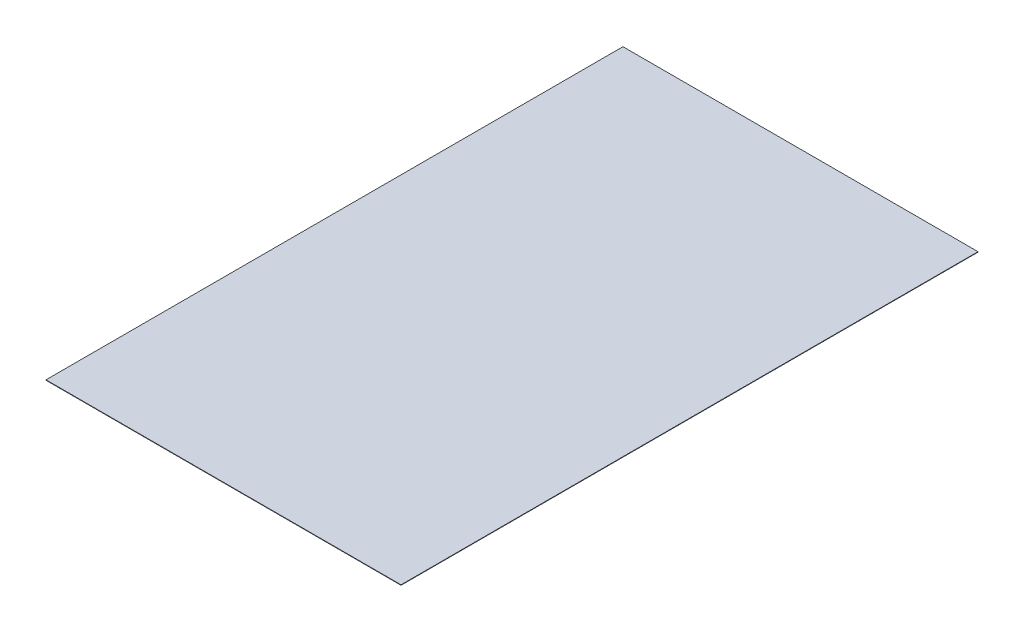
ISO-10303-21;
HEADER;
FILE_DESCRIPTION(('STEP AP214'),'2;1');
FILE_NAME('part.step','',(''),(''),'','','');
FILE_SCHEMA(('AUTOMOTIVE_DESIGN { 1 0 10303 214 1 1 1 1 }'));
ENDSEC;
DATA;
#1=APPLICATION_CONTEXT('core data for automotive mechanical design processes');
#2=APPLICATION_PROTOCOL_DEFINITION('international standard','automotive_design',2000,#1);
#3=PRODUCT_CONTEXT('',#1,'mechanical');
#4=PRODUCT('Part','Part','',(#3));
#5=PRODUCT_RELATED_PRODUCT_CATEGORY('part','',(#4));
#6=PRODUCT_DEFINITION_FORMATION('','',#4);
#7=PRODUCT_DEFINITION_CONTEXT('part definition',#1,'design');
#8=PRODUCT_DEFINITION('design','',#6,#7);
#9=PRODUCT_DEFINITION_SHAPE('','',#8);
#10=(LENGTH_UNIT() NAMED_UNIT(*) SI_UNIT(.MILLI.,.METRE.));
#11=(NAMED_UNIT(*) PLANE_ANGLE_UNIT() SI_UNIT($,.RADIAN.));
#12=(NAMED_UNIT(*) SI_UNIT($,.STERADIAN.) SOLID_ANGLE_UNIT());
#13=UNCERTAINTY_MEASURE_WITH_UNIT(LENGTH_MEASURE(1.E-05),#10,'distance_accuracy_value','');
#14=(GEOMETRIC_REPRESENTATION_CONTEXT(3) GLOBAL_UNCERTAINTY_ASSIGNED_CONTEXT((#13)) GLOBAL_UNIT_ASSIGNED_CONTEXT((#10,
#11,#12)) REPRESENTATION_CONTEXT('',''));
#15=CARTESIAN_POINT('',(0.,0.,0.));
#16=DIRECTION('',(0.,0.,1.));
#17=DIRECTION('',(1.,0.,0.));
#18=AXIS2_PLACEMENT_3D('',#15,#16,#17);
#19=CARTESIAN_POINT('',(0.,0.5,0.));
#20=DIRECTION('',(1.,0.,0.));
#21=DIRECTION('',(0.,0.,-1.));
#22=AXIS2_PLACEMENT_3D('',#19,#20,#21);
#23=PLANE('',#22);
#24=DIRECTION('',(0.,0.,1.));
#25=VECTOR('',#24,1.);
#26=CARTESIAN_POINT('',(0.,0.,0.));
#27=LINE('',#26,#25);
#28=CARTESIAN_POINT('',(0.,0.,-650.));
#29=VERTEX_POINT('',#28);
#30=CARTESIAN_POINT('',(0.,0.,0.));
#31=VERTEX_POINT('',#30);
#32=EDGE_CURVE('E98',#29,#31,#27,.T.);
#33=ORIENTED_EDGE('',*,*,#32,.T.);
#34=DIRECTION('',(0.,-1.,0.));
#35=VECTOR('',#34,1.);
#36=CARTESIAN_POINT('',(0.,0.5,0.));
#37=LINE('',#36,#35);
#38=CARTESIAN_POINT('',(0.,0.5,0.));
#39=VERTEX_POINT('',#38);
#40=EDGE_CURVE('E11',#39,#31,#37,.T.);
#41=ORIENTED_EDGE('',*,*,#40,.F.);
#42=DIRECTION('',(0.,0.,1.));
#43=VECTOR('',#42,1.);
#44=CARTESIAN_POINT('',(0.,0.5,0.));
#45=LINE('',#44,#43);
#46=CARTESIAN_POINT('',(0.,0.5,-650.));
#47=VERTEX_POINT('',#46);
#48=EDGE_CURVE('E86',#47,#39,#45,.T.);
#49=ORIENTED_EDGE('',*,*,#48,.F.);
#50=DIRECTION('',(0.,-1.,0.));
#51=VECTOR('',#50,1.);
#52=CARTESIAN_POINT('',(0.,0.5,-650.));
#53=LINE('',#52,#51);
#54=EDGE_CURVE('E94',#47,#29,#53,.T.);
#55=ORIENTED_EDGE('',*,*,#54,.T.);
#56=EDGE_LOOP('',(#33,#41,#49,#55));
#57=FACE_BOUND('',#56,.T.);
#58=ADVANCED_FACE('F35',(#57),#23,.F.);
#59=CARTESIAN_POINT('',(0.,0.5,0.));
#60=DIRECTION('',(0.,0.,-1.));
#61=DIRECTION('',(-1.,0.,0.));
#62=AXIS2_PLACEMENT_3D('',#59,#60,#61);
#63=PLANE('',#62);
#64=DIRECTION('',(1.,0.,0.));
#65=VECTOR('',#64,1.);
#66=CARTESIAN_POINT('',(0.,0.,0.));
#67=LINE('',#66,#65);
#68=CARTESIAN_POINT('',(400.,0.,0.));
#69=VERTEX_POINT('',#68);
#70=EDGE_CURVE('E90',#31,#69,#67,.T.);
#71=ORIENTED_EDGE('',*,*,#70,.T.);
#72=DIRECTION('',(0.,-1.,0.));
#73=VECTOR('',#72,1.);
#74=CARTESIAN_POINT('',(400.,0.5,0.));
#75=LINE('',#74,#73);
#76=CARTESIAN_POINT('',(400.,0.5,0.));
#77=VERTEX_POINT('',#76);
#78=EDGE_CURVE('E43',#77,#69,#75,.T.);
#79=ORIENTED_EDGE('',*,*,#78,.F.);
#80=DIRECTION('',(1.,0.,0.));
#81=VECTOR('',#80,1.);
#82=CARTESIAN_POINT('',(0.,0.5,0.));
#83=LINE('',#82,#81);
#84=EDGE_CURVE('E81',#39,#77,#83,.T.);
#85=ORIENTED_EDGE('',*,*,#84,.F.);
#86=ORIENTED_EDGE('',*,*,#40,.T.);
#87=EDGE_LOOP('',(#71,#79,#85,#86));
#88=FACE_BOUND('',#87,.T.);
#89=ADVANCED_FACE('F89',(#88),#63,.F.);
#90=CARTESIAN_POINT('',(400.,0.5,0.));
#91=DIRECTION('',(-1.,0.,0.));
#92=DIRECTION('',(0.,0.,1.));
#93=AXIS2_PLACEMENT_3D('',#90,#91,#92);
#94=PLANE('',#93);
#95=DIRECTION('',(0.,0.,-1.));
#96=VECTOR('',#95,1.);
#97=CARTESIAN_POINT('',(400.,0.,0.));
#98=LINE('',#97,#96);
#99=CARTESIAN_POINT('',(400.,0.,-650.));
#100=VERTEX_POINT('',#99);
#101=EDGE_CURVE('E68',#69,#100,#98,.T.);
#102=ORIENTED_EDGE('',*,*,#101,.T.);
#103=DIRECTION('',(0.,-1.,0.));
#104=VECTOR('',#103,1.);
#105=CARTESIAN_POINT('',(400.,0.5,-650.));
#106=LINE('',#105,#104);
#107=CARTESIAN_POINT('',(400.,0.5,-650.));
#108=VERTEX_POINT('',#107);
#109=EDGE_CURVE('E91',#108,#100,#106,.T.);
#110=ORIENTED_EDGE('',*,*,#109,.F.);
#111=DIRECTION('',(0.,0.,-1.));
#112=VECTOR('',#111,1.);
#113=CARTESIAN_POINT('',(400.,0.5,0.));
#114=LINE('',#113,#112);
#115=EDGE_CURVE('E84',#77,#108,#114,.T.);
#116=ORIENTED_EDGE('',*,*,#115,.F.);
#117=ORIENTED_EDGE('',*,*,#78,.T.);
#118=EDGE_LOOP('',(#102,#110,#116,#117));
#119=FACE_BOUND('',#118,.T.);
#120=ADVANCED_FACE('F92',(#119),#94,.F.);
#121=CARTESIAN_POINT('',(0.,0.5,-650.));
#122=DIRECTION('',(0.,0.,1.));
#123=DIRECTION('',(1.,0.,0.));
#124=AXIS2_PLACEMENT_3D('',#121,#122,#123);
#125=PLANE('',#124);
#126=DIRECTION('',(-1.,0.,0.));
#127=VECTOR('',#126,1.);
#128=CARTESIAN_POINT('',(0.,0.,-650.));
#129=LINE('',#128,#127);
#130=EDGE_CURVE('E74',#100,#29,#129,.T.);
#131=ORIENTED_EDGE('',*,*,#130,.T.);
#132=ORIENTED_EDGE('',*,*,#54,.F.);
#133=DIRECTION('',(-1.,0.,0.));
#134=VECTOR('',#133,1.);
#135=CARTESIAN_POINT('',(0.,0.5,-650.));
#136=LINE('',#135,#134);
#137=EDGE_CURVE('E51',#108,#47,#136,.T.);
#138=ORIENTED_EDGE('',*,*,#137,.F.);
#139=ORIENTED_EDGE('',*,*,#109,.T.);
#140=EDGE_LOOP('',(#131,#132,#138,#139));
#141=FACE_BOUND('',#140,.T.);
#142=ADVANCED_FACE('F105',(#141),#125,.F.);
#143=CARTESIAN_POINT('',(0.,0.5,0.));
#144=DIRECTION('',(0.,-1.,0.));
#145=DIRECTION('',(0.,0.,-1.));
#146=AXIS2_PLACEMENT_3D('',#143,#144,#145);
#147=PLANE('',#146);
#148=ORIENTED_EDGE('',*,*,#48,.T.);
#149=ORIENTED_EDGE('',*,*,#84,.T.);
#150=ORIENTED_EDGE('',*,*,#115,.T.);
#151=ORIENTED_EDGE('',*,*,#137,.T.);
#152=EDGE_LOOP('',(#148,#149,#150,#151));
#153=FACE_BOUND('',#152,.T.);
#154=ADVANCED_FACE('F82',(#153),#147,.F.);
#155=CARTESIAN_POINT('',(0.,0.,0.));
#156=DIRECTION('',(0.,-1.,0.));
#157=DIRECTION('',(0.,0.,-1.));
#158=AXIS2_PLACEMENT_3D('',#155,#156,#157);
#159=PLANE('',#158);
#160=ORIENTED_EDGE('',*,*,#32,.F.);
#161=ORIENTED_EDGE('',*,*,#130,.F.);
#162=ORIENTED_EDGE('',*,*,#101,.F.);
#163=ORIENTED_EDGE('',*,*,#70,.F.);
#164=EDGE_LOOP('',(#160,#161,#162,#163));
#165=FACE_BOUND('',#164,.T.);
#166=ADVANCED_FACE('F108',(#165),#159,.T.);
#167=CLOSED_SHELL('',(#58,#89,#120,#142,#154,#166));
#168=MANIFOLD_SOLID_BREP('B2',#167);
#169=ADVANCED_BREP_SHAPE_REPRESENTATION('',(#18,#168),#14);
#170=SHAPE_DEFINITION_REPRESENTATION(#9,#169);
ENDSEC;
END-ISO-10303-21;
